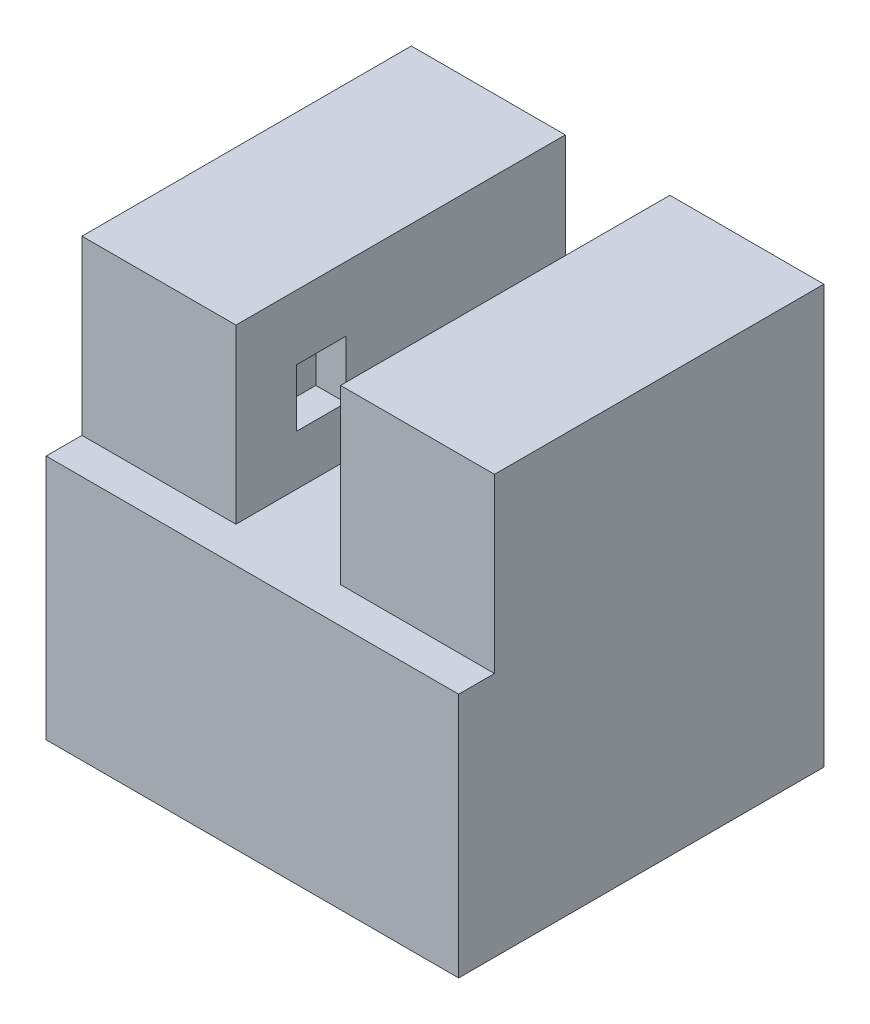
ISO-10303-21;
HEADER;
FILE_DESCRIPTION(('STEP AP214'),'2;1');
FILE_NAME('part.step','',(''),(''),'','','');
FILE_SCHEMA(('AUTOMOTIVE_DESIGN { 1 0 10303 214 1 1 1 1 }'));
ENDSEC;
DATA;
#1=APPLICATION_CONTEXT('core data for automotive mechanical design processes');
#2=APPLICATION_PROTOCOL_DEFINITION('international standard','automotive_design',2000,#1);
#3=PRODUCT_CONTEXT('',#1,'mechanical');
#4=PRODUCT('Part','Part','',(#3));
#5=PRODUCT_RELATED_PRODUCT_CATEGORY('part','',(#4));
#6=PRODUCT_DEFINITION_FORMATION('','',#4);
#7=PRODUCT_DEFINITION_CONTEXT('part definition',#1,'design');
#8=PRODUCT_DEFINITION('design','',#6,#7);
#9=PRODUCT_DEFINITION_SHAPE('','',#8);
#10=(LENGTH_UNIT() NAMED_UNIT(*) SI_UNIT(.MILLI.,.METRE.));
#11=(NAMED_UNIT(*) PLANE_ANGLE_UNIT() SI_UNIT($,.RADIAN.));
#12=(NAMED_UNIT(*) SI_UNIT($,.STERADIAN.) SOLID_ANGLE_UNIT());
#13=UNCERTAINTY_MEASURE_WITH_UNIT(LENGTH_MEASURE(1.E-05),#10,'distance_accuracy_value','');
#14=(GEOMETRIC_REPRESENTATION_CONTEXT(3) GLOBAL_UNCERTAINTY_ASSIGNED_CONTEXT((#13)) GLOBAL_UNIT_ASSIGNED_CONTEXT((#10,
#11,#12)) REPRESENTATION_CONTEXT('',''));
#15=CARTESIAN_POINT('',(0.,0.,0.));
#16=DIRECTION('',(0.,0.,1.));
#17=DIRECTION('',(1.,0.,0.));
#18=AXIS2_PLACEMENT_3D('',#15,#16,#17);
#19=CARTESIAN_POINT('',(-9.35,25.4,10.));
#20=DIRECTION('',(0.,0.,-1.));
#21=DIRECTION('',(-1.,0.,0.));
#22=AXIS2_PLACEMENT_3D('',#19,#20,#21);
#23=PLANE('',#22);
#24=DIRECTION('',(0.,-1.,0.));
#25=VECTOR('',#24,1.);
#26=CARTESIAN_POINT('',(-12.525,25.4,10.));
#27=LINE('',#26,#25);
#28=CARTESIAN_POINT('',(-12.525,25.4,10.));
#29=VERTEX_POINT('',#28);
#30=CARTESIAN_POINT('',(-12.525,14.925,10.));
#31=VERTEX_POINT('',#30);
#32=EDGE_CURVE('E403',#29,#31,#27,.T.);
#33=ORIENTED_EDGE('',*,*,#32,.T.);
#34=DIRECTION('',(1.,0.,0.));
#35=VECTOR('',#34,1.);
#36=CARTESIAN_POINT('',(-27.6076473140493,14.925,10.));
#37=LINE('',#36,#35);
#38=CARTESIAN_POINT('',(-3.175,14.925,10.));
#39=VERTEX_POINT('',#38);
#40=EDGE_CURVE('E44',#31,#39,#37,.T.);
#41=ORIENTED_EDGE('',*,*,#40,.T.);
#42=DIRECTION('',(0.,-1.,0.));
#43=VECTOR('',#42,1.);
#44=CARTESIAN_POINT('',(-3.175,0.,10.));
#45=LINE('',#44,#43);
#46=CARTESIAN_POINT('',(-3.175,25.4,10.));
#47=VERTEX_POINT('',#46);
#48=EDGE_CURVE('E423',#47,#39,#45,.T.);
#49=ORIENTED_EDGE('',*,*,#48,.F.);
#50=DIRECTION('',(1.,0.,0.));
#51=VECTOR('',#50,1.);
#52=CARTESIAN_POINT('',(-9.35,25.4,10.));
#53=LINE('',#52,#51);
#54=EDGE_CURVE('E446',#29,#47,#53,.T.);
#55=ORIENTED_EDGE('',*,*,#54,.F.);
#56=EDGE_LOOP('',(#33,#41,#49,#55));
#57=FACE_BOUND('',#56,.T.);
#58=ADVANCED_FACE('F33',(#57),#23,.F.);
#59=CARTESIAN_POINT('',(0.,0.,6.825));
#60=DIRECTION('',(0.,0.,-1.));
#61=DIRECTION('',(-1.,0.,0.));
#62=AXIS2_PLACEMENT_3D('',#59,#60,#61);
#63=PLANE('',#62);
#64=DIRECTION('',(1.,0.,0.));
#65=VECTOR('',#64,1.);
#66=CARTESIAN_POINT('',(0.,10.125,6.825));
#67=LINE('',#66,#65);
#68=CARTESIAN_POINT('',(-9.35,10.125,6.825));
#69=VERTEX_POINT('',#68);
#70=CARTESIAN_POINT('',(-5.,10.125,6.825));
#71=VERTEX_POINT('',#70);
#72=EDGE_CURVE('E42',#69,#71,#67,.T.);
#73=ORIENTED_EDGE('',*,*,#72,.F.);
#74=DIRECTION('',(0.,1.,0.));
#75=VECTOR('',#74,1.);
#76=CARTESIAN_POINT('',(-9.35,0.,6.825));
#77=LINE('',#76,#75);
#78=CARTESIAN_POINT('',(-9.35,22.225,6.825));
#79=VERTEX_POINT('',#78);
#80=EDGE_CURVE('E366',#69,#79,#77,.T.);
#81=ORIENTED_EDGE('',*,*,#80,.T.);
#82=DIRECTION('',(1.,0.,0.));
#83=VECTOR('',#82,1.);
#84=CARTESIAN_POINT('',(0.,22.225,6.825));
#85=LINE('',#84,#83);
#86=CARTESIAN_POINT('',(-5.,22.225,6.825));
#87=VERTEX_POINT('',#86);
#88=EDGE_CURVE('E368',#79,#87,#85,.T.);
#89=ORIENTED_EDGE('',*,*,#88,.T.);
#90=DIRECTION('',(0.,1.,0.));
#91=VECTOR('',#90,1.);
#92=CARTESIAN_POINT('',(-5.,0.,6.825));
#93=LINE('',#92,#91);
#94=EDGE_CURVE('E355',#71,#87,#93,.T.);
#95=ORIENTED_EDGE('',*,*,#94,.F.);
#96=EDGE_LOOP('',(#73,#81,#89,#95));
#97=FACE_BOUND('',#96,.T.);
#98=ADVANCED_FACE('F528',(#97),#63,.T.);
#99=DIRECTION('',(0.,-1.,0.));
#100=VECTOR('',#99,1.);
#101=CARTESIAN_POINT('',(3.175,0.,10.));
#102=LINE('',#101,#100);
#103=CARTESIAN_POINT('',(3.175,25.4,10.));
#104=VERTEX_POINT('',#103);
#105=CARTESIAN_POINT('',(3.175,14.925,10.));
#106=VERTEX_POINT('',#105);
#107=EDGE_CURVE('E426',#104,#106,#102,.T.);
#108=ORIENTED_EDGE('',*,*,#107,.T.);
#109=CARTESIAN_POINT('',(12.525,14.925,10.));
#110=VERTEX_POINT('',#109);
#111=EDGE_CURVE('E11',#106,#110,#37,.T.);
#112=ORIENTED_EDGE('',*,*,#111,.T.);
#113=DIRECTION('',(0.,1.,0.));
#114=VECTOR('',#113,1.);
#115=CARTESIAN_POINT('',(12.525,25.4,10.));
#116=LINE('',#115,#114);
#117=CARTESIAN_POINT('',(12.525,25.4,10.));
#118=VERTEX_POINT('',#117);
#119=EDGE_CURVE('E412',#110,#118,#116,.T.);
#120=ORIENTED_EDGE('',*,*,#119,.T.);
#121=EDGE_CURVE('E450',#104,#118,#53,.T.);
#122=ORIENTED_EDGE('',*,*,#121,.F.);
#123=EDGE_LOOP('',(#108,#112,#120,#122));
#124=FACE_BOUND('',#123,.T.);
#125=ADVANCED_FACE('F35',(#124),#23,.F.);
#126=CARTESIAN_POINT('',(-9.35,25.4,-10.));
#127=DIRECTION('',(0.,0.,1.));
#128=DIRECTION('',(1.,0.,0.));
#129=AXIS2_PLACEMENT_3D('',#126,#127,#128);
#130=PLANE('',#129);
#131=DIRECTION('',(-1.,0.,0.));
#132=VECTOR('',#131,1.);
#133=CARTESIAN_POINT('',(-9.35,0.,-10.));
#134=LINE('',#133,#132);
#135=CARTESIAN_POINT('',(12.525,0.,-10.));
#136=VERTEX_POINT('',#135);
#137=CARTESIAN_POINT('',(11.,0.,-10.));
#138=VERTEX_POINT('',#137);
#139=EDGE_CURVE('E453',#136,#138,#134,.T.);
#140=ORIENTED_EDGE('',*,*,#139,.T.);
#141=DIRECTION('',(0.,-1.,0.));
#142=VECTOR('',#141,1.);
#143=CARTESIAN_POINT('',(11.,10.125,-10.));
#144=LINE('',#143,#142);
#145=CARTESIAN_POINT('',(11.,10.125,-10.));
#146=VERTEX_POINT('',#145);
#147=EDGE_CURVE('E261',#146,#138,#144,.T.);
#148=ORIENTED_EDGE('',*,*,#147,.F.);
#149=DIRECTION('',(1.,0.,0.));
#150=VECTOR('',#149,1.);
#151=CARTESIAN_POINT('',(11.,10.125,-10.));
#152=LINE('',#151,#150);
#153=CARTESIAN_POINT('',(9.35,10.125,-10.));
#154=VERTEX_POINT('',#153);
#155=EDGE_CURVE('E280',#154,#146,#152,.T.);
#156=ORIENTED_EDGE('',*,*,#155,.F.);
#157=DIRECTION('',(0.,-1.,0.));
#158=VECTOR('',#157,1.);
#159=CARTESIAN_POINT('',(9.35,0.,-10.));
#160=LINE('',#159,#158);
#161=CARTESIAN_POINT('',(9.35,22.225,-10.));
#162=VERTEX_POINT('',#161);
#163=EDGE_CURVE('E383',#162,#154,#160,.T.);
#164=ORIENTED_EDGE('',*,*,#163,.F.);
#165=DIRECTION('',(-1.,0.,0.));
#166=VECTOR('',#165,1.);
#167=CARTESIAN_POINT('',(0.,22.225,-10.));
#168=LINE('',#167,#166);
#169=CARTESIAN_POINT('',(5.,22.225,-10.));
#170=VERTEX_POINT('',#169);
#171=EDGE_CURVE('E380',#162,#170,#168,.T.);
#172=ORIENTED_EDGE('',*,*,#171,.T.);
#173=DIRECTION('',(0.,-1.,0.));
#174=VECTOR('',#173,1.);
#175=CARTESIAN_POINT('',(5.,0.,-10.));
#176=LINE('',#175,#174);
#177=CARTESIAN_POINT('',(5.,10.125,-10.));
#178=VERTEX_POINT('',#177);
#179=EDGE_CURVE('E377',#170,#178,#176,.T.);
#180=ORIENTED_EDGE('',*,*,#179,.T.);
#181=DIRECTION('',(-1.,0.,0.));
#182=VECTOR('',#181,1.);
#183=CARTESIAN_POINT('',(0.,10.125,-10.));
#184=LINE('',#183,#182);
#185=CARTESIAN_POINT('',(-5.,10.125,-10.));
#186=VERTEX_POINT('',#185);
#187=EDGE_CURVE('E374',#178,#186,#184,.T.);
#188=ORIENTED_EDGE('',*,*,#187,.T.);
#189=DIRECTION('',(0.,1.,0.));
#190=VECTOR('',#189,1.);
#191=CARTESIAN_POINT('',(-5.,0.,-10.));
#192=LINE('',#191,#190);
#193=CARTESIAN_POINT('',(-5.,22.225,-10.));
#194=VERTEX_POINT('',#193);
#195=EDGE_CURVE('E354',#186,#194,#192,.T.);
#196=ORIENTED_EDGE('',*,*,#195,.T.);
#197=DIRECTION('',(1.,0.,0.));
#198=VECTOR('',#197,1.);
#199=CARTESIAN_POINT('',(0.,22.225,-10.));
#200=LINE('',#199,#198);
#201=CARTESIAN_POINT('',(-9.35,22.225,-10.));
#202=VERTEX_POINT('',#201);
#203=EDGE_CURVE('E358',#202,#194,#200,.T.);
#204=ORIENTED_EDGE('',*,*,#203,.F.);
#205=DIRECTION('',(0.,1.,0.));
#206=VECTOR('',#205,1.);
#207=CARTESIAN_POINT('',(-9.35,0.,-10.));
#208=LINE('',#207,#206);
#209=CARTESIAN_POINT('',(-9.35,10.125,-10.));
#210=VERTEX_POINT('',#209);
#211=EDGE_CURVE('E386',#210,#202,#208,.T.);
#212=ORIENTED_EDGE('',*,*,#211,.F.);
#213=CARTESIAN_POINT('',(-11.,10.125,-10.));
#214=VERTEX_POINT('',#213);
#215=EDGE_CURVE('E266',#214,#210,#152,.T.);
#216=ORIENTED_EDGE('',*,*,#215,.F.);
#217=DIRECTION('',(0.,1.,0.));
#218=VECTOR('',#217,1.);
#219=CARTESIAN_POINT('',(-11.,10.125,-10.));
#220=LINE('',#219,#218);
#221=CARTESIAN_POINT('',(-11.,0.,-10.));
#222=VERTEX_POINT('',#221);
#223=EDGE_CURVE('E277',#222,#214,#220,.T.);
#224=ORIENTED_EDGE('',*,*,#223,.F.);
#225=CARTESIAN_POINT('',(-12.525,0.,-10.));
#226=VERTEX_POINT('',#225);
#227=EDGE_CURVE('E439',#222,#226,#134,.T.);
#228=ORIENTED_EDGE('',*,*,#227,.T.);
#229=DIRECTION('',(0.,1.,0.));
#230=VECTOR('',#229,1.);
#231=CARTESIAN_POINT('',(-12.525,25.4,-10.));
#232=LINE('',#231,#230);
#233=CARTESIAN_POINT('',(-12.525,25.4,-10.));
#234=VERTEX_POINT('',#233);
#235=EDGE_CURVE('E392',#226,#234,#232,.T.);
#236=ORIENTED_EDGE('',*,*,#235,.T.);
#237=DIRECTION('',(-1.,0.,0.));
#238=VECTOR('',#237,1.);
#239=CARTESIAN_POINT('',(-9.35,25.4,-10.));
#240=LINE('',#239,#238);
#241=CARTESIAN_POINT('',(-3.175,25.4,-10.));
#242=VERTEX_POINT('',#241);
#243=EDGE_CURVE('E449',#242,#234,#240,.T.);
#244=ORIENTED_EDGE('',*,*,#243,.F.);
#245=DIRECTION('',(0.,-1.,0.));
#246=VECTOR('',#245,1.);
#247=CARTESIAN_POINT('',(-3.175,0.,-10.));
#248=LINE('',#247,#246);
#249=CARTESIAN_POINT('',(-3.175,14.925,-10.));
#250=VERTEX_POINT('',#249);
#251=EDGE_CURVE('E414',#242,#250,#248,.T.);
#252=ORIENTED_EDGE('',*,*,#251,.T.);
#253=DIRECTION('',(-1.,0.,0.));
#254=VECTOR('',#253,1.);
#255=CARTESIAN_POINT('',(0.,14.925,-10.));
#256=LINE('',#255,#254);
#257=CARTESIAN_POINT('',(3.175,14.925,-10.));
#258=VERTEX_POINT('',#257);
#259=EDGE_CURVE('E427',#258,#250,#256,.T.);
#260=ORIENTED_EDGE('',*,*,#259,.F.);
#261=DIRECTION('',(0.,-1.,0.));
#262=VECTOR('',#261,1.);
#263=CARTESIAN_POINT('',(3.175,0.,-10.));
#264=LINE('',#263,#262);
#265=CARTESIAN_POINT('',(3.175,25.4,-10.));
#266=VERTEX_POINT('',#265);
#267=EDGE_CURVE('E433',#266,#258,#264,.T.);
#268=ORIENTED_EDGE('',*,*,#267,.F.);
#269=CARTESIAN_POINT('',(12.525,25.4,-10.));
#270=VERTEX_POINT('',#269);
#271=EDGE_CURVE('E451',#270,#266,#240,.T.);
#272=ORIENTED_EDGE('',*,*,#271,.F.);
#273=DIRECTION('',(0.,-1.,0.));
#274=VECTOR('',#273,1.);
#275=CARTESIAN_POINT('',(12.525,25.4,-10.));
#276=LINE('',#275,#274);
#277=EDGE_CURVE('E405',#270,#136,#276,.T.);
#278=ORIENTED_EDGE('',*,*,#277,.T.);
#279=EDGE_LOOP('',(#140,#148,#156,#164,#172,#180,#188,#196,#204,#212,#216,#224,#228,#236,#244,
#252,#260,#268,#272,#278));
#280=FACE_BOUND('',#279,.T.);
#281=ADVANCED_FACE('F460',(#280),#130,.F.);
#282=CARTESIAN_POINT('',(0.,25.4,0.));
#283=DIRECTION('',(0.,1.,0.));
#284=DIRECTION('',(0.,0.,1.));
#285=AXIS2_PLACEMENT_3D('',#282,#283,#284);
#286=PLANE('',#285);
#287=ORIENTED_EDGE('',*,*,#54,.T.);
#288=DIRECTION('',(0.,0.,-1.));
#289=VECTOR('',#288,1.);
#290=CARTESIAN_POINT('',(-3.175,25.4,10.));
#291=LINE('',#290,#289);
#292=EDGE_CURVE('E430',#47,#242,#291,.T.);
#293=ORIENTED_EDGE('',*,*,#292,.T.);
#294=ORIENTED_EDGE('',*,*,#243,.T.);
#295=DIRECTION('',(0.,0.,-1.));
#296=VECTOR('',#295,1.);
#297=CARTESIAN_POINT('',(-12.525,25.4,35.5976683508479));
#298=LINE('',#297,#296);
#299=EDGE_CURVE('E406',#29,#234,#298,.T.);
#300=ORIENTED_EDGE('',*,*,#299,.F.);
#301=EDGE_LOOP('',(#287,#293,#294,#300));
#302=FACE_BOUND('',#301,.T.);
#303=ADVANCED_FACE('F469',(#302),#286,.T.);
#304=DIRECTION('',(0.,0.,-1.));
#305=VECTOR('',#304,1.);
#306=CARTESIAN_POINT('',(3.175,25.4,10.));
#307=LINE('',#306,#305);
#308=EDGE_CURVE('E442',#104,#266,#307,.T.);
#309=ORIENTED_EDGE('',*,*,#308,.F.);
#310=ORIENTED_EDGE('',*,*,#121,.T.);
#311=DIRECTION('',(0.,0.,-1.));
#312=VECTOR('',#311,1.);
#313=CARTESIAN_POINT('',(12.525,25.4,35.5976683508479));
#314=LINE('',#313,#312);
#315=EDGE_CURVE('E418',#118,#270,#314,.T.);
#316=ORIENTED_EDGE('',*,*,#315,.T.);
#317=ORIENTED_EDGE('',*,*,#271,.T.);
#318=EDGE_LOOP('',(#309,#310,#316,#317));
#319=FACE_BOUND('',#318,.T.);
#320=ADVANCED_FACE('F480',(#319),#286,.T.);
#321=CARTESIAN_POINT('',(0.,0.,0.));
#322=DIRECTION('',(0.,1.,0.));
#323=DIRECTION('',(0.,0.,1.));
#324=AXIS2_PLACEMENT_3D('',#321,#322,#323);
#325=PLANE('',#324);
#326=DIRECTION('',(-1.,0.,0.));
#327=VECTOR('',#326,1.);
#328=CARTESIAN_POINT('',(11.,0.,9.));
#329=LINE('',#328,#327);
#330=CARTESIAN_POINT('',(11.,0.,9.));
#331=VERTEX_POINT('',#330);
#332=CARTESIAN_POINT('',(-11.,0.,9.));
#333=VERTEX_POINT('',#332);
#334=EDGE_CURVE('E265',#331,#333,#329,.T.);
#335=ORIENTED_EDGE('',*,*,#334,.F.);
#336=DIRECTION('',(0.,0.,-1.));
#337=VECTOR('',#336,1.);
#338=CARTESIAN_POINT('',(11.,0.,9.));
#339=LINE('',#338,#337);
#340=EDGE_CURVE('E275',#331,#138,#339,.T.);
#341=ORIENTED_EDGE('',*,*,#340,.T.);
#342=ORIENTED_EDGE('',*,*,#139,.F.);
#343=DIRECTION('',(0.,0.,-1.));
#344=VECTOR('',#343,1.);
#345=CARTESIAN_POINT('',(12.525,0.,35.5976683508479));
#346=LINE('',#345,#344);
#347=CARTESIAN_POINT('',(12.525,0.,12.175));
#348=VERTEX_POINT('',#347);
#349=EDGE_CURVE('E415',#348,#136,#346,.T.);
#350=ORIENTED_EDGE('',*,*,#349,.F.);
#351=DIRECTION('',(1.,0.,0.));
#352=VECTOR('',#351,1.);
#353=CARTESIAN_POINT('',(-27.6076473140494,0.,12.175));
#354=LINE('',#353,#352);
#355=CARTESIAN_POINT('',(-12.525,0.,12.175));
#356=VERTEX_POINT('',#355);
#357=EDGE_CURVE('E244',#356,#348,#354,.T.);
#358=ORIENTED_EDGE('',*,*,#357,.F.);
#359=DIRECTION('',(0.,0.,-1.));
#360=VECTOR('',#359,1.);
#361=CARTESIAN_POINT('',(-12.525,0.,35.5976683508479));
#362=LINE('',#361,#360);
#363=EDGE_CURVE('E240',#356,#226,#362,.T.);
#364=ORIENTED_EDGE('',*,*,#363,.T.);
#365=ORIENTED_EDGE('',*,*,#227,.F.);
#366=DIRECTION('',(0.,0.,-1.));
#367=VECTOR('',#366,1.);
#368=CARTESIAN_POINT('',(-11.,0.,9.));
#369=LINE('',#368,#367);
#370=EDGE_CURVE('E288',#333,#222,#369,.T.);
#371=ORIENTED_EDGE('',*,*,#370,.F.);
#372=EDGE_LOOP('',(#335,#341,#342,#350,#358,#364,#365,#371));
#373=FACE_BOUND('',#372,.T.);
#374=ADVANCED_FACE('F466',(#373),#325,.F.);
#375=CARTESIAN_POINT('',(-3.175,0.,10.));
#376=DIRECTION('',(1.,0.,0.));
#377=DIRECTION('',(0.,1.,0.));
#378=AXIS2_PLACEMENT_3D('',#375,#376,#377);
#379=PLANE('',#378);
#380=DIRECTION('',(0.,0.,-1.));
#381=VECTOR('',#380,1.);
#382=CARTESIAN_POINT('',(-3.175,17.975,10.));
#383=LINE('',#382,#381);
#384=CARTESIAN_POINT('',(-3.175,17.975,6.325));
#385=VERTEX_POINT('',#384);
#386=CARTESIAN_POINT('',(-3.175,17.975,3.325));
#387=VERTEX_POINT('',#386);
#388=EDGE_CURVE('E352',#385,#387,#383,.T.);
#389=ORIENTED_EDGE('',*,*,#388,.F.);
#390=DIRECTION('',(0.,-1.,0.));
#391=VECTOR('',#390,1.);
#392=CARTESIAN_POINT('',(-3.175,0.,6.325));
#393=LINE('',#392,#391);
#394=CARTESIAN_POINT('',(-3.175,21.475,6.325));
#395=VERTEX_POINT('',#394);
#396=EDGE_CURVE('E337',#395,#385,#393,.T.);
#397=ORIENTED_EDGE('',*,*,#396,.F.);
#398=DIRECTION('',(0.,0.,1.));
#399=VECTOR('',#398,1.);
#400=CARTESIAN_POINT('',(-3.175,21.475,10.));
#401=LINE('',#400,#399);
#402=CARTESIAN_POINT('',(-3.175,21.475,3.325));
#403=VERTEX_POINT('',#402);
#404=EDGE_CURVE('E342',#403,#395,#401,.T.);
#405=ORIENTED_EDGE('',*,*,#404,.F.);
#406=DIRECTION('',(0.,1.,0.));
#407=VECTOR('',#406,1.);
#408=CARTESIAN_POINT('',(-3.175,0.,3.32500000000001));
#409=LINE('',#408,#407);
#410=EDGE_CURVE('E347',#387,#403,#409,.T.);
#411=ORIENTED_EDGE('',*,*,#410,.F.);
#412=EDGE_LOOP('',(#389,#397,#405,#411));
#413=FACE_BOUND('',#412,.T.);
#414=ORIENTED_EDGE('',*,*,#251,.F.);
#415=ORIENTED_EDGE('',*,*,#292,.F.);
#416=ORIENTED_EDGE('',*,*,#48,.T.);
#417=DIRECTION('',(0.,0.,-1.));
#418=VECTOR('',#417,1.);
#419=CARTESIAN_POINT('',(-3.175,14.925,10.));
#420=LINE('',#419,#418);
#421=EDGE_CURVE('E437',#39,#250,#420,.T.);
#422=ORIENTED_EDGE('',*,*,#421,.T.);
#423=EDGE_LOOP('',(#414,#415,#416,#422));
#424=FACE_BOUND('',#423,.T.);
#425=ADVANCED_FACE('F473',(#413,#424),#379,.T.);
#426=CARTESIAN_POINT('',(0.,14.925,10.));
#427=DIRECTION('',(0.,-1.,0.));
#428=DIRECTION('',(0.,0.,-1.));
#429=AXIS2_PLACEMENT_3D('',#426,#427,#428);
#430=PLANE('',#429);
#431=ORIENTED_EDGE('',*,*,#259,.T.);
#432=ORIENTED_EDGE('',*,*,#421,.F.);
#433=ORIENTED_EDGE('',*,*,#40,.F.);
#434=DIRECTION('',(0.,0.,1.));
#435=VECTOR('',#434,1.);
#436=CARTESIAN_POINT('',(-12.525,14.925,10.));
#437=LINE('',#436,#435);
#438=CARTESIAN_POINT('',(-12.525,14.925,12.175));
#439=VERTEX_POINT('',#438);
#440=EDGE_CURVE('E236',#31,#439,#437,.T.);
#441=ORIENTED_EDGE('',*,*,#440,.T.);
#442=DIRECTION('',(1.,0.,0.));
#443=VECTOR('',#442,1.);
#444=CARTESIAN_POINT('',(-27.6076473140493,14.925,12.175));
#445=LINE('',#444,#443);
#446=CARTESIAN_POINT('',(12.525,14.925,12.175));
#447=VERTEX_POINT('',#446);
#448=EDGE_CURVE('E245',#439,#447,#445,.T.);
#449=ORIENTED_EDGE('',*,*,#448,.T.);
#450=DIRECTION('',(0.,0.,1.));
#451=VECTOR('',#450,1.);
#452=CARTESIAN_POINT('',(12.525,14.925,10.));
#453=LINE('',#452,#451);
#454=EDGE_CURVE('E51',#110,#447,#453,.T.);
#455=ORIENTED_EDGE('',*,*,#454,.F.);
#456=ORIENTED_EDGE('',*,*,#111,.F.);
#457=DIRECTION('',(0.,0.,-1.));
#458=VECTOR('',#457,1.);
#459=CARTESIAN_POINT('',(3.175,14.925,10.));
#460=LINE('',#459,#458);
#461=EDGE_CURVE('E440',#106,#258,#460,.T.);
#462=ORIENTED_EDGE('',*,*,#461,.T.);
#463=EDGE_LOOP('',(#431,#432,#433,#441,#449,#455,#456,#462));
#464=FACE_BOUND('',#463,.T.);
#465=ADVANCED_FACE('F253',(#464),#430,.F.);
#466=CARTESIAN_POINT('',(3.175,0.,10.));
#467=DIRECTION('',(1.,0.,0.));
#468=DIRECTION('',(0.,1.,0.));
#469=AXIS2_PLACEMENT_3D('',#466,#467,#468);
#470=PLANE('',#469);
#471=DIRECTION('',(0.,-1.,0.));
#472=VECTOR('',#471,1.);
#473=CARTESIAN_POINT('',(3.175,0.,6.325));
#474=LINE('',#473,#472);
#475=CARTESIAN_POINT('',(3.175,21.475,6.325));
#476=VERTEX_POINT('',#475);
#477=CARTESIAN_POINT('',(3.175,17.975,6.325));
#478=VERTEX_POINT('',#477);
#479=EDGE_CURVE('E334',#476,#478,#474,.T.);
#480=ORIENTED_EDGE('',*,*,#479,.T.);
#481=DIRECTION('',(0.,0.,-1.));
#482=VECTOR('',#481,1.);
#483=CARTESIAN_POINT('',(3.175,17.975,10.));
#484=LINE('',#483,#482);
#485=CARTESIAN_POINT('',(3.175,17.975,3.325));
#486=VERTEX_POINT('',#485);
#487=EDGE_CURVE('E349',#478,#486,#484,.T.);
#488=ORIENTED_EDGE('',*,*,#487,.T.);
#489=DIRECTION('',(0.,1.,0.));
#490=VECTOR('',#489,1.);
#491=CARTESIAN_POINT('',(3.175,0.,3.32500000000001));
#492=LINE('',#491,#490);
#493=CARTESIAN_POINT('',(3.175,21.475,3.325));
#494=VERTEX_POINT('',#493);
#495=EDGE_CURVE('E344',#486,#494,#492,.T.);
#496=ORIENTED_EDGE('',*,*,#495,.T.);
#497=DIRECTION('',(0.,0.,1.));
#498=VECTOR('',#497,1.);
#499=CARTESIAN_POINT('',(3.175,21.475,10.));
#500=LINE('',#499,#498);
#501=EDGE_CURVE('E339',#494,#476,#500,.T.);
#502=ORIENTED_EDGE('',*,*,#501,.T.);
#503=EDGE_LOOP('',(#480,#488,#496,#502));
#504=FACE_BOUND('',#503,.T.);
#505=ORIENTED_EDGE('',*,*,#267,.T.);
#506=ORIENTED_EDGE('',*,*,#461,.F.);
#507=ORIENTED_EDGE('',*,*,#107,.F.);
#508=ORIENTED_EDGE('',*,*,#308,.T.);
#509=EDGE_LOOP('',(#505,#506,#507,#508));
#510=FACE_BOUND('',#509,.T.);
#511=ADVANCED_FACE('F477',(#504,#510),#470,.F.);
#512=CARTESIAN_POINT('',(12.525,25.4,35.5976683508479));
#513=DIRECTION('',(1.,0.,0.));
#514=DIRECTION('',(0.,1.,0.));
#515=AXIS2_PLACEMENT_3D('',#512,#513,#514);
#516=PLANE('',#515);
#517=ORIENTED_EDGE('',*,*,#119,.F.);
#518=ORIENTED_EDGE('',*,*,#454,.T.);
#519=DIRECTION('',(0.,-1.,0.));
#520=VECTOR('',#519,1.);
#521=CARTESIAN_POINT('',(12.525,14.925,12.175));
#522=LINE('',#521,#520);
#523=EDGE_CURVE('E250',#447,#348,#522,.T.);
#524=ORIENTED_EDGE('',*,*,#523,.T.);
#525=ORIENTED_EDGE('',*,*,#349,.T.);
#526=ORIENTED_EDGE('',*,*,#277,.F.);
#527=ORIENTED_EDGE('',*,*,#315,.F.);
#528=EDGE_LOOP('',(#517,#518,#524,#525,#526,#527));
#529=FACE_BOUND('',#528,.T.);
#530=ADVANCED_FACE('F486',(#529),#516,.T.);
#531=CARTESIAN_POINT('',(-12.525,25.4,35.5976683508479));
#532=DIRECTION('',(-1.,0.,0.));
#533=DIRECTION('',(0.,-1.,0.));
#534=AXIS2_PLACEMENT_3D('',#531,#532,#533);
#535=PLANE('',#534);
#536=ORIENTED_EDGE('',*,*,#32,.F.);
#537=ORIENTED_EDGE('',*,*,#299,.T.);
#538=ORIENTED_EDGE('',*,*,#235,.F.);
#539=ORIENTED_EDGE('',*,*,#363,.F.);
#540=DIRECTION('',(0.,-1.,0.));
#541=VECTOR('',#540,1.);
#542=CARTESIAN_POINT('',(-12.525,14.925,12.175));
#543=LINE('',#542,#541);
#544=EDGE_CURVE('E231',#439,#356,#543,.T.);
#545=ORIENTED_EDGE('',*,*,#544,.F.);
#546=ORIENTED_EDGE('',*,*,#440,.F.);
#547=EDGE_LOOP('',(#536,#537,#538,#539,#545,#546));
#548=FACE_BOUND('',#547,.T.);
#549=ADVANCED_FACE('F234',(#548),#535,.T.);
#550=CARTESIAN_POINT('',(-5.,0.,6.825));
#551=DIRECTION('',(-1.,0.,0.));
#552=DIRECTION('',(0.,-1.,0.));
#553=AXIS2_PLACEMENT_3D('',#550,#551,#552);
#554=PLANE('',#553);
#555=DIRECTION('',(0.,0.,-1.));
#556=VECTOR('',#555,1.);
#557=CARTESIAN_POINT('',(-5.,17.975,6.325));
#558=LINE('',#557,#556);
#559=CARTESIAN_POINT('',(-5.,17.975,6.325));
#560=VERTEX_POINT('',#559);
#561=CARTESIAN_POINT('',(-5.,17.975,3.325));
#562=VERTEX_POINT('',#561);
#563=EDGE_CURVE('E300',#560,#562,#558,.T.);
#564=ORIENTED_EDGE('',*,*,#563,.T.);
#565=DIRECTION('',(0.,1.,0.));
#566=VECTOR('',#565,1.);
#567=CARTESIAN_POINT('',(-5.,21.475,3.325));
#568=LINE('',#567,#566);
#569=CARTESIAN_POINT('',(-5.,21.475,3.325));
#570=VERTEX_POINT('',#569);
#571=EDGE_CURVE('E321',#562,#570,#568,.T.);
#572=ORIENTED_EDGE('',*,*,#571,.T.);
#573=DIRECTION('',(0.,0.,1.));
#574=VECTOR('',#573,1.);
#575=CARTESIAN_POINT('',(-5.,21.475,6.325));
#576=LINE('',#575,#574);
#577=CARTESIAN_POINT('',(-5.,21.475,6.325));
#578=VERTEX_POINT('',#577);
#579=EDGE_CURVE('E316',#570,#578,#576,.T.);
#580=ORIENTED_EDGE('',*,*,#579,.T.);
#581=DIRECTION('',(0.,-1.,0.));
#582=VECTOR('',#581,1.);
#583=CARTESIAN_POINT('',(-5.,21.475,6.325));
#584=LINE('',#583,#582);
#585=EDGE_CURVE('E312',#578,#560,#584,.T.);
#586=ORIENTED_EDGE('',*,*,#585,.T.);
#587=EDGE_LOOP('',(#564,#572,#580,#586));
#588=FACE_BOUND('',#587,.T.);
#589=ORIENTED_EDGE('',*,*,#195,.F.);
#590=DIRECTION('',(0.,0.,-1.));
#591=VECTOR('',#590,1.);
#592=CARTESIAN_POINT('',(-5.,10.125,6.825));
#593=LINE('',#592,#591);
#594=EDGE_CURVE('E371',#71,#186,#593,.T.);
#595=ORIENTED_EDGE('',*,*,#594,.F.);
#596=ORIENTED_EDGE('',*,*,#94,.T.);
#597=DIRECTION('',(0.,0.,-1.));
#598=VECTOR('',#597,1.);
#599=CARTESIAN_POINT('',(-5.,22.225,6.825));
#600=LINE('',#599,#598);
#601=EDGE_CURVE('E390',#87,#194,#600,.T.);
#602=ORIENTED_EDGE('',*,*,#601,.T.);
#603=EDGE_LOOP('',(#589,#595,#596,#602));
#604=FACE_BOUND('',#603,.T.);
#605=ADVANCED_FACE('F516',(#588,#604),#554,.T.);
#606=CARTESIAN_POINT('',(0.,22.225,6.825));
#607=DIRECTION('',(0.,1.,0.));
#608=DIRECTION('',(0.,0.,1.));
#609=AXIS2_PLACEMENT_3D('',#606,#607,#608);
#610=PLANE('',#609);
#611=ORIENTED_EDGE('',*,*,#203,.T.);
#612=ORIENTED_EDGE('',*,*,#601,.F.);
#613=ORIENTED_EDGE('',*,*,#88,.F.);
#614=DIRECTION('',(0.,0.,-1.));
#615=VECTOR('',#614,1.);
#616=CARTESIAN_POINT('',(-9.35,22.225,6.825));
#617=LINE('',#616,#615);
#618=EDGE_CURVE('E393',#79,#202,#617,.T.);
#619=ORIENTED_EDGE('',*,*,#618,.T.);
#620=EDGE_LOOP('',(#611,#612,#613,#619));
#621=FACE_BOUND('',#620,.T.);
#622=ADVANCED_FACE('F521',(#621),#610,.F.);
#623=CARTESIAN_POINT('',(-9.35,0.,6.825));
#624=DIRECTION('',(-1.,0.,0.));
#625=DIRECTION('',(0.,-1.,0.));
#626=AXIS2_PLACEMENT_3D('',#623,#624,#625);
#627=PLANE('',#626);
#628=ORIENTED_EDGE('',*,*,#80,.F.);
#629=DIRECTION('',(0.,0.,-1.));
#630=VECTOR('',#629,1.);
#631=CARTESIAN_POINT('',(-9.35,10.125,6.825));
#632=LINE('',#631,#630);
#633=EDGE_CURVE('E294',#69,#210,#632,.T.);
#634=ORIENTED_EDGE('',*,*,#633,.T.);
#635=ORIENTED_EDGE('',*,*,#211,.T.);
#636=ORIENTED_EDGE('',*,*,#618,.F.);
#637=EDGE_LOOP('',(#628,#634,#635,#636));
#638=FACE_BOUND('',#637,.T.);
#639=ADVANCED_FACE('F526',(#638),#627,.F.);
#640=CARTESIAN_POINT('',(9.35,0.,6.825));
#641=DIRECTION('',(1.,0.,0.));
#642=DIRECTION('',(0.,0.,-1.));
#643=AXIS2_PLACEMENT_3D('',#640,#641,#642);
#644=PLANE('',#643);
#645=ORIENTED_EDGE('',*,*,#163,.T.);
#646=DIRECTION('',(0.,0.,1.));
#647=VECTOR('',#646,1.);
#648=CARTESIAN_POINT('',(9.35,10.125,6.825));
#649=LINE('',#648,#647);
#650=CARTESIAN_POINT('',(9.35,10.125,6.825));
#651=VERTEX_POINT('',#650);
#652=EDGE_CURVE('E285',#154,#651,#649,.T.);
#653=ORIENTED_EDGE('',*,*,#652,.T.);
#654=DIRECTION('',(0.,-1.,0.));
#655=VECTOR('',#654,1.);
#656=CARTESIAN_POINT('',(9.35,0.,6.825));
#657=LINE('',#656,#655);
#658=CARTESIAN_POINT('',(9.35,22.225,6.825));
#659=VERTEX_POINT('',#658);
#660=EDGE_CURVE('E363',#659,#651,#657,.T.);
#661=ORIENTED_EDGE('',*,*,#660,.F.);
#662=DIRECTION('',(0.,0.,-1.));
#663=VECTOR('',#662,1.);
#664=CARTESIAN_POINT('',(9.35,22.225,6.825));
#665=LINE('',#664,#663);
#666=EDGE_CURVE('E396',#659,#162,#665,.T.);
#667=ORIENTED_EDGE('',*,*,#666,.T.);
#668=EDGE_LOOP('',(#645,#653,#661,#667));
#669=FACE_BOUND('',#668,.T.);
#670=ADVANCED_FACE('F499',(#669),#644,.F.);
#671=CARTESIAN_POINT('',(0.,22.225,6.825));
#672=DIRECTION('',(0.,-1.,0.));
#673=DIRECTION('',(0.,0.,-1.));
#674=AXIS2_PLACEMENT_3D('',#671,#672,#673);
#675=PLANE('',#674);
#676=ORIENTED_EDGE('',*,*,#171,.F.);
#677=ORIENTED_EDGE('',*,*,#666,.F.);
#678=DIRECTION('',(-1.,0.,0.));
#679=VECTOR('',#678,1.);
#680=CARTESIAN_POINT('',(0.,22.225,6.825));
#681=LINE('',#680,#679);
#682=CARTESIAN_POINT('',(5.,22.225,6.825));
#683=VERTEX_POINT('',#682);
#684=EDGE_CURVE('E361',#659,#683,#681,.T.);
#685=ORIENTED_EDGE('',*,*,#684,.T.);
#686=DIRECTION('',(0.,0.,-1.));
#687=VECTOR('',#686,1.);
#688=CARTESIAN_POINT('',(5.,22.225,6.825));
#689=LINE('',#688,#687);
#690=EDGE_CURVE('E398',#683,#170,#689,.T.);
#691=ORIENTED_EDGE('',*,*,#690,.T.);
#692=EDGE_LOOP('',(#676,#677,#685,#691));
#693=FACE_BOUND('',#692,.T.);
#694=ADVANCED_FACE('F504',(#693),#675,.T.);
#695=CARTESIAN_POINT('',(5.,0.,6.825));
#696=DIRECTION('',(1.,0.,0.));
#697=DIRECTION('',(0.,1.,0.));
#698=AXIS2_PLACEMENT_3D('',#695,#696,#697);
#699=PLANE('',#698);
#700=DIRECTION('',(0.,0.,-1.));
#701=VECTOR('',#700,1.);
#702=CARTESIAN_POINT('',(5.,17.975,6.325));
#703=LINE('',#702,#701);
#704=CARTESIAN_POINT('',(5.,17.975,6.325));
#705=VERTEX_POINT('',#704);
#706=CARTESIAN_POINT('',(5.,17.975,3.325));
#707=VERTEX_POINT('',#706);
#708=EDGE_CURVE('E304',#705,#707,#703,.T.);
#709=ORIENTED_EDGE('',*,*,#708,.F.);
#710=DIRECTION('',(0.,-1.,0.));
#711=VECTOR('',#710,1.);
#712=CARTESIAN_POINT('',(5.,21.475,6.325));
#713=LINE('',#712,#711);
#714=CARTESIAN_POINT('',(5.,21.475,6.325));
#715=VERTEX_POINT('',#714);
#716=EDGE_CURVE('E297',#715,#705,#713,.T.);
#717=ORIENTED_EDGE('',*,*,#716,.F.);
#718=DIRECTION('',(0.,0.,1.));
#719=VECTOR('',#718,1.);
#720=CARTESIAN_POINT('',(5.,21.475,6.325));
#721=LINE('',#720,#719);
#722=CARTESIAN_POINT('',(5.,21.475,3.325));
#723=VERTEX_POINT('',#722);
#724=EDGE_CURVE('E298',#723,#715,#721,.T.);
#725=ORIENTED_EDGE('',*,*,#724,.F.);
#726=DIRECTION('',(0.,1.,0.));
#727=VECTOR('',#726,1.);
#728=CARTESIAN_POINT('',(5.,21.475,3.325));
#729=LINE('',#728,#727);
#730=EDGE_CURVE('E301',#707,#723,#729,.T.);
#731=ORIENTED_EDGE('',*,*,#730,.F.);
#732=EDGE_LOOP('',(#709,#717,#725,#731));
#733=FACE_BOUND('',#732,.T.);
#734=ORIENTED_EDGE('',*,*,#179,.F.);
#735=ORIENTED_EDGE('',*,*,#690,.F.);
#736=DIRECTION('',(0.,-1.,0.));
#737=VECTOR('',#736,1.);
#738=CARTESIAN_POINT('',(5.,0.,6.825));
#739=LINE('',#738,#737);
#740=CARTESIAN_POINT('',(5.,10.125,6.825));
#741=VERTEX_POINT('',#740);
#742=EDGE_CURVE('E357',#683,#741,#739,.T.);
#743=ORIENTED_EDGE('',*,*,#742,.T.);
#744=DIRECTION('',(0.,0.,-1.));
#745=VECTOR('',#744,1.);
#746=CARTESIAN_POINT('',(5.,10.125,6.825));
#747=LINE('',#746,#745);
#748=EDGE_CURVE('E400',#741,#178,#747,.T.);
#749=ORIENTED_EDGE('',*,*,#748,.T.);
#750=EDGE_LOOP('',(#734,#735,#743,#749));
#751=FACE_BOUND('',#750,.T.);
#752=ADVANCED_FACE('F508',(#733,#751),#699,.T.);
#753=CARTESIAN_POINT('',(0.,10.125,6.825));
#754=DIRECTION('',(0.,-1.,0.));
#755=DIRECTION('',(0.,0.,-1.));
#756=AXIS2_PLACEMENT_3D('',#753,#754,#755);
#757=PLANE('',#756);
#758=ORIENTED_EDGE('',*,*,#187,.F.);
#759=ORIENTED_EDGE('',*,*,#748,.F.);
#760=EDGE_CURVE('E37',#741,#651,#67,.T.);
#761=ORIENTED_EDGE('',*,*,#760,.T.);
#762=ORIENTED_EDGE('',*,*,#652,.F.);
#763=ORIENTED_EDGE('',*,*,#155,.T.);
#764=DIRECTION('',(0.,0.,-1.));
#765=VECTOR('',#764,1.);
#766=CARTESIAN_POINT('',(11.,10.125,9.));
#767=LINE('',#766,#765);
#768=CARTESIAN_POINT('',(11.,10.125,9.));
#769=VERTEX_POINT('',#768);
#770=EDGE_CURVE('E282',#769,#146,#767,.T.);
#771=ORIENTED_EDGE('',*,*,#770,.F.);
#772=DIRECTION('',(1.,0.,0.));
#773=VECTOR('',#772,1.);
#774=CARTESIAN_POINT('',(11.,10.125,9.));
#775=LINE('',#774,#773);
#776=CARTESIAN_POINT('',(-11.,10.125,9.));
#777=VERTEX_POINT('',#776);
#778=EDGE_CURVE('E272',#777,#769,#775,.T.);
#779=ORIENTED_EDGE('',*,*,#778,.F.);
#780=DIRECTION('',(0.,0.,-1.));
#781=VECTOR('',#780,1.);
#782=CARTESIAN_POINT('',(-11.,10.125,9.));
#783=LINE('',#782,#781);
#784=EDGE_CURVE('E286',#777,#214,#783,.T.);
#785=ORIENTED_EDGE('',*,*,#784,.T.);
#786=ORIENTED_EDGE('',*,*,#215,.T.);
#787=ORIENTED_EDGE('',*,*,#633,.F.);
#788=ORIENTED_EDGE('',*,*,#72,.T.);
#789=ORIENTED_EDGE('',*,*,#594,.T.);
#790=EDGE_LOOP('',(#758,#759,#761,#762,#763,#771,#779,#785,#786,#787,#788,#789));
#791=FACE_BOUND('',#790,.T.);
#792=ADVANCED_FACE('F495',(#791),#757,.T.);
#793=ORIENTED_EDGE('',*,*,#760,.F.);
#794=ORIENTED_EDGE('',*,*,#742,.F.);
#795=ORIENTED_EDGE('',*,*,#684,.F.);
#796=ORIENTED_EDGE('',*,*,#660,.T.);
#797=EDGE_LOOP('',(#793,#794,#795,#796));
#798=FACE_BOUND('',#797,.T.);
#799=ADVANCED_FACE('F530',(#798),#63,.T.);
#800=CARTESIAN_POINT('',(-9.60977222864645,21.475,6.325));
#801=DIRECTION('',(0.,0.,1.));
#802=DIRECTION('',(1.,0.,0.));
#803=AXIS2_PLACEMENT_3D('',#800,#801,#802);
#804=PLANE('',#803);
#805=DIRECTION('',(1.,0.,0.));
#806=VECTOR('',#805,1.);
#807=CARTESIAN_POINT('',(-9.60977222864645,21.475,6.325));
#808=LINE('',#807,#806);
#809=EDGE_CURVE('E319',#476,#715,#808,.T.);
#810=ORIENTED_EDGE('',*,*,#809,.T.);
#811=ORIENTED_EDGE('',*,*,#716,.T.);
#812=DIRECTION('',(1.,0.,0.));
#813=VECTOR('',#812,1.);
#814=CARTESIAN_POINT('',(-9.60977222864645,17.975,6.325));
#815=LINE('',#814,#813);
#816=EDGE_CURVE('E315',#478,#705,#815,.T.);
#817=ORIENTED_EDGE('',*,*,#816,.F.);
#818=ORIENTED_EDGE('',*,*,#479,.F.);
#819=EDGE_LOOP('',(#810,#811,#817,#818));
#820=FACE_BOUND('',#819,.T.);
#821=ADVANCED_FACE('F532',(#820),#804,.F.);
#822=CARTESIAN_POINT('',(-9.60977222864645,21.475,6.325));
#823=DIRECTION('',(0.,1.,0.));
#824=DIRECTION('',(-1.,0.,0.));
#825=AXIS2_PLACEMENT_3D('',#822,#823,#824);
#826=PLANE('',#825);
#827=DIRECTION('',(1.,0.,0.));
#828=VECTOR('',#827,1.);
#829=CARTESIAN_POINT('',(-9.60977222864645,21.475,3.325));
#830=LINE('',#829,#828);
#831=EDGE_CURVE('E324',#494,#723,#830,.T.);
#832=ORIENTED_EDGE('',*,*,#831,.T.);
#833=ORIENTED_EDGE('',*,*,#724,.T.);
#834=ORIENTED_EDGE('',*,*,#809,.F.);
#835=ORIENTED_EDGE('',*,*,#501,.F.);
#836=EDGE_LOOP('',(#832,#833,#834,#835));
#837=FACE_BOUND('',#836,.T.);
#838=ADVANCED_FACE('F538',(#837),#826,.F.);
#839=CARTESIAN_POINT('',(-9.60977222864645,21.475,3.325));
#840=DIRECTION('',(0.,0.,-1.));
#841=DIRECTION('',(0.,1.,0.));
#842=AXIS2_PLACEMENT_3D('',#839,#840,#841);
#843=PLANE('',#842);
#844=DIRECTION('',(1.,0.,0.));
#845=VECTOR('',#844,1.);
#846=CARTESIAN_POINT('',(-9.60977222864645,17.975,3.325));
#847=LINE('',#846,#845);
#848=EDGE_CURVE('E311',#486,#707,#847,.T.);
#849=ORIENTED_EDGE('',*,*,#848,.T.);
#850=ORIENTED_EDGE('',*,*,#730,.T.);
#851=ORIENTED_EDGE('',*,*,#831,.F.);
#852=ORIENTED_EDGE('',*,*,#495,.F.);
#853=EDGE_LOOP('',(#849,#850,#851,#852));
#854=FACE_BOUND('',#853,.T.);
#855=ADVANCED_FACE('F723',(#854),#843,.F.);
#856=CARTESIAN_POINT('',(-9.60977222864645,17.975,6.325));
#857=DIRECTION('',(0.,-1.,0.));
#858=DIRECTION('',(1.,0.,0.));
#859=AXIS2_PLACEMENT_3D('',#856,#857,#858);
#860=PLANE('',#859);
#861=ORIENTED_EDGE('',*,*,#816,.T.);
#862=ORIENTED_EDGE('',*,*,#708,.T.);
#863=ORIENTED_EDGE('',*,*,#848,.F.);
#864=ORIENTED_EDGE('',*,*,#487,.F.);
#865=EDGE_LOOP('',(#861,#862,#863,#864));
#866=FACE_BOUND('',#865,.T.);
#867=ADVANCED_FACE('F725',(#866),#860,.F.);
#868=ORIENTED_EDGE('',*,*,#388,.T.);
#869=EDGE_CURVE('E325',#562,#387,#847,.T.);
#870=ORIENTED_EDGE('',*,*,#869,.F.);
#871=ORIENTED_EDGE('',*,*,#563,.F.);
#872=EDGE_CURVE('E331',#560,#385,#815,.T.);
#873=ORIENTED_EDGE('',*,*,#872,.T.);
#874=EDGE_LOOP('',(#868,#870,#871,#873));
#875=FACE_BOUND('',#874,.T.);
#876=ADVANCED_FACE('F721',(#875),#860,.F.);
#877=ORIENTED_EDGE('',*,*,#410,.T.);
#878=EDGE_CURVE('E320',#570,#403,#830,.T.);
#879=ORIENTED_EDGE('',*,*,#878,.F.);
#880=ORIENTED_EDGE('',*,*,#571,.F.);
#881=ORIENTED_EDGE('',*,*,#869,.T.);
#882=EDGE_LOOP('',(#877,#879,#880,#881));
#883=FACE_BOUND('',#882,.T.);
#884=ADVANCED_FACE('F718',(#883),#843,.F.);
#885=ORIENTED_EDGE('',*,*,#404,.T.);
#886=EDGE_CURVE('E58',#578,#395,#808,.T.);
#887=ORIENTED_EDGE('',*,*,#886,.F.);
#888=ORIENTED_EDGE('',*,*,#579,.F.);
#889=ORIENTED_EDGE('',*,*,#878,.T.);
#890=EDGE_LOOP('',(#885,#887,#888,#889));
#891=FACE_BOUND('',#890,.T.);
#892=ADVANCED_FACE('F715',(#891),#826,.F.);
#893=ORIENTED_EDGE('',*,*,#396,.T.);
#894=ORIENTED_EDGE('',*,*,#872,.F.);
#895=ORIENTED_EDGE('',*,*,#585,.F.);
#896=ORIENTED_EDGE('',*,*,#886,.T.);
#897=EDGE_LOOP('',(#893,#894,#895,#896));
#898=FACE_BOUND('',#897,.T.);
#899=ADVANCED_FACE('F541',(#898),#804,.F.);
#900=CARTESIAN_POINT('',(11.,10.125,9.));
#901=DIRECTION('',(1.,0.,0.));
#902=DIRECTION('',(0.,0.,-1.));
#903=AXIS2_PLACEMENT_3D('',#900,#901,#902);
#904=PLANE('',#903);
#905=ORIENTED_EDGE('',*,*,#147,.T.);
#906=ORIENTED_EDGE('',*,*,#340,.F.);
#907=DIRECTION('',(0.,-1.,0.));
#908=VECTOR('',#907,1.);
#909=CARTESIAN_POINT('',(11.,10.125,9.));
#910=LINE('',#909,#908);
#911=EDGE_CURVE('E262',#769,#331,#910,.T.);
#912=ORIENTED_EDGE('',*,*,#911,.F.);
#913=ORIENTED_EDGE('',*,*,#770,.T.);
#914=EDGE_LOOP('',(#905,#906,#912,#913));
#915=FACE_BOUND('',#914,.T.);
#916=ADVANCED_FACE('F489',(#915),#904,.F.);
#917=CARTESIAN_POINT('',(-11.,10.125,9.));
#918=DIRECTION('',(-1.,0.,0.));
#919=DIRECTION('',(0.,-1.,0.));
#920=AXIS2_PLACEMENT_3D('',#917,#918,#919);
#921=PLANE('',#920);
#922=ORIENTED_EDGE('',*,*,#223,.T.);
#923=ORIENTED_EDGE('',*,*,#784,.F.);
#924=DIRECTION('',(0.,1.,0.));
#925=VECTOR('',#924,1.);
#926=CARTESIAN_POINT('',(-11.,10.125,9.));
#927=LINE('',#926,#925);
#928=EDGE_CURVE('E269',#333,#777,#927,.T.);
#929=ORIENTED_EDGE('',*,*,#928,.F.);
#930=ORIENTED_EDGE('',*,*,#370,.T.);
#931=EDGE_LOOP('',(#922,#923,#929,#930));
#932=FACE_BOUND('',#931,.T.);
#933=ADVANCED_FACE('F630',(#932),#921,.F.);
#934=CARTESIAN_POINT('',(0.,0.,9.));
#935=DIRECTION('',(0.,0.,-1.));
#936=DIRECTION('',(-1.,0.,0.));
#937=AXIS2_PLACEMENT_3D('',#934,#935,#936);
#938=PLANE('',#937);
#939=ORIENTED_EDGE('',*,*,#911,.T.);
#940=ORIENTED_EDGE('',*,*,#334,.T.);
#941=ORIENTED_EDGE('',*,*,#928,.T.);
#942=ORIENTED_EDGE('',*,*,#778,.T.);
#943=EDGE_LOOP('',(#939,#940,#941,#942));
#944=FACE_BOUND('',#943,.T.);
#945=ADVANCED_FACE('F491',(#944),#938,.T.);
#946=CARTESIAN_POINT('',(-27.6076473140493,14.925,12.175));
#947=DIRECTION('',(0.,0.,1.));
#948=DIRECTION('',(0.,-1.,0.));
#949=AXIS2_PLACEMENT_3D('',#946,#947,#948);
#950=PLANE('',#949);
#951=ORIENTED_EDGE('',*,*,#448,.F.);
#952=ORIENTED_EDGE('',*,*,#544,.T.);
#953=ORIENTED_EDGE('',*,*,#357,.T.);
#954=ORIENTED_EDGE('',*,*,#523,.F.);
#955=EDGE_LOOP('',(#951,#952,#953,#954));
#956=FACE_BOUND('',#955,.T.);
#957=ADVANCED_FACE('F248',(#956),#950,.T.);
#958=CLOSED_SHELL('',(#58,#98,#125,#281,#303,#320,#374,#425,#465,#511,#530,#549,#605,#622,#639,
#670,#694,#752,#792,#799,#821,#838,#855,#867,#876,#884,#892,#899,#916,#933,#945,#957));
#959=MANIFOLD_SOLID_BREP('B2',#958);
#960=ADVANCED_BREP_SHAPE_REPRESENTATION('',(#18,#959),#14);
#961=SHAPE_DEFINITION_REPRESENTATION(#9,#960);
ENDSEC;
END-ISO-10303-21;
